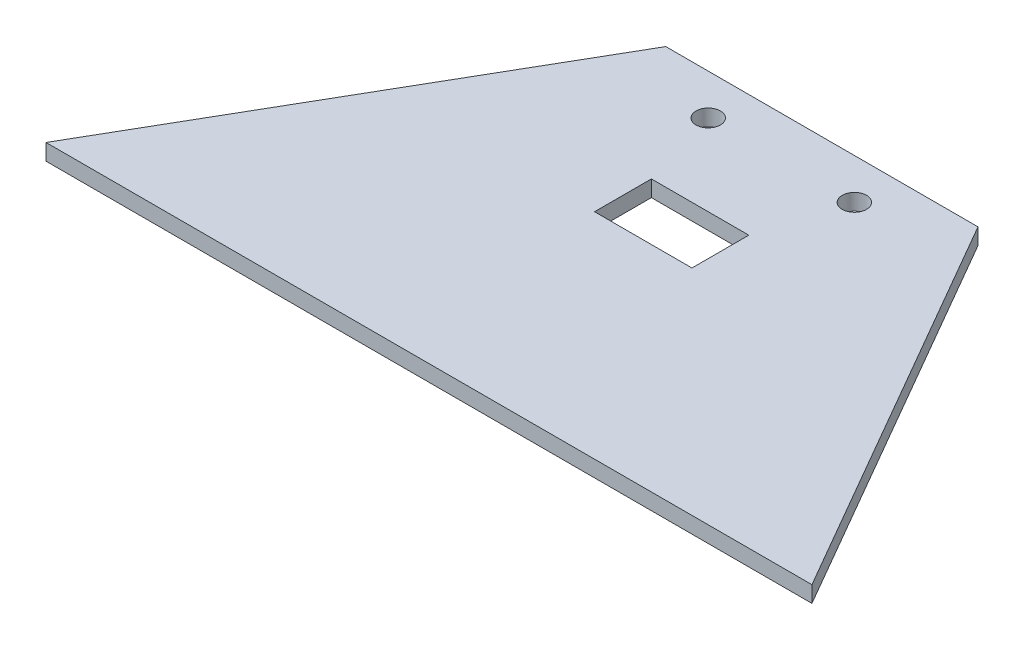
ISO-10303-21;
HEADER;
FILE_DESCRIPTION(('STEP AP214'),'2;1');
FILE_NAME('part.step','',(''),(''),'','','');
FILE_SCHEMA(('AUTOMOTIVE_DESIGN { 1 0 10303 214 1 1 1 1 }'));
ENDSEC;
DATA;
#1=APPLICATION_CONTEXT('core data for automotive mechanical design processes');
#2=APPLICATION_PROTOCOL_DEFINITION('international standard','automotive_design',2000,#1);
#3=PRODUCT_CONTEXT('',#1,'mechanical');
#4=PRODUCT('Part','Part','',(#3));
#5=PRODUCT_RELATED_PRODUCT_CATEGORY('part','',(#4));
#6=PRODUCT_DEFINITION_FORMATION('','',#4);
#7=PRODUCT_DEFINITION_CONTEXT('part definition',#1,'design');
#8=PRODUCT_DEFINITION('design','',#6,#7);
#9=PRODUCT_DEFINITION_SHAPE('','',#8);
#10=(LENGTH_UNIT() NAMED_UNIT(*) SI_UNIT(.MILLI.,.METRE.));
#11=(NAMED_UNIT(*) PLANE_ANGLE_UNIT() SI_UNIT($,.RADIAN.));
#12=(NAMED_UNIT(*) SI_UNIT($,.STERADIAN.) SOLID_ANGLE_UNIT());
#13=UNCERTAINTY_MEASURE_WITH_UNIT(LENGTH_MEASURE(1.E-05),#10,'distance_accuracy_value','');
#14=(GEOMETRIC_REPRESENTATION_CONTEXT(3) GLOBAL_UNCERTAINTY_ASSIGNED_CONTEXT((#13)) GLOBAL_UNIT_ASSIGNED_CONTEXT((#10,
#11,#12)) REPRESENTATION_CONTEXT('',''));
#15=CARTESIAN_POINT('',(0.,0.,0.));
#16=DIRECTION('',(0.,0.,1.));
#17=DIRECTION('',(1.,0.,0.));
#18=AXIS2_PLACEMENT_3D('',#15,#16,#17);
#19=CARTESIAN_POINT('',(20.135868436399,2.,-39.1327219471372));
#20=DIRECTION('',(0.,-1.,0.));
#21=DIRECTION('',(0.,0.,-1.));
#22=AXIS2_PLACEMENT_3D('',#19,#20,#21);
#23=PLANE('',#22);
#24=DIRECTION('',(1.,0.,0.));
#25=VECTOR('',#24,1.);
#26=CARTESIAN_POINT('',(6.90937112829526,2.,-17.1327219471372));
#27=LINE('',#26,#25);
#28=CARTESIAN_POINT('',(-5.09062887170475,2.,-17.1327219471372));
#29=VERTEX_POINT('',#28);
#30=CARTESIAN_POINT('',(6.90937112829526,2.,-17.1327219471372));
#31=VERTEX_POINT('',#30);
#32=EDGE_CURVE('E96',#29,#31,#27,.T.);
#33=ORIENTED_EDGE('',*,*,#32,.F.);
#34=DIRECTION('',(0.,0.,1.));
#35=VECTOR('',#34,1.);
#36=CARTESIAN_POINT('',(-5.09062887170474,2.,-24.1327219471372));
#37=LINE('',#36,#35);
#38=CARTESIAN_POINT('',(-5.09062887170474,2.,-24.1327219471372));
#39=VERTEX_POINT('',#38);
#40=EDGE_CURVE('E119',#39,#29,#37,.T.);
#41=ORIENTED_EDGE('',*,*,#40,.F.);
#42=DIRECTION('',(-1.,0.,0.));
#43=VECTOR('',#42,1.);
#44=CARTESIAN_POINT('',(-5.09062887170474,2.,-24.1327219471372));
#45=LINE('',#44,#43);
#46=CARTESIAN_POINT('',(6.90937112829526,2.,-24.1327219471372));
#47=VERTEX_POINT('',#46);
#48=EDGE_CURVE('E117',#47,#39,#45,.T.);
#49=ORIENTED_EDGE('',*,*,#48,.F.);
#50=DIRECTION('',(0.,0.,-1.));
#51=VECTOR('',#50,1.);
#52=CARTESIAN_POINT('',(6.90937112829526,2.,-24.1327219471372));
#53=LINE('',#52,#51);
#54=EDGE_CURVE('E104',#31,#47,#53,.T.);
#55=ORIENTED_EDGE('',*,*,#54,.F.);
#56=EDGE_LOOP('',(#33,#41,#49,#55));
#57=FACE_BOUND('',#56,.T.);
#58=DIRECTION('',(-0.500000000000002,0.,-0.866025403784438));
#59=VECTOR('',#58,1.);
#60=CARTESIAN_POINT('',(48.0744346377564,2.,9.25829420424034));
#61=LINE('',#60,#59);
#62=CARTESIAN_POINT('',(48.0744346377564,2.,9.25829420424034));
#63=VERTEX_POINT('',#62);
#64=CARTESIAN_POINT('',(20.135868436399,2.,-39.1327219471372));
#65=VERTEX_POINT('',#64);
#66=EDGE_CURVE('E141',#63,#65,#61,.T.);
#67=ORIENTED_EDGE('',*,*,#66,.T.);
#68=DIRECTION('',(-1.,0.,0.));
#69=VECTOR('',#68,1.);
#70=CARTESIAN_POINT('',(-18.3171261798084,2.,-39.1327219471372));
#71=LINE('',#70,#69);
#72=CARTESIAN_POINT('',(-18.3171261798084,2.,-39.1327219471372));
#73=VERTEX_POINT('',#72);
#74=EDGE_CURVE('E144',#65,#73,#71,.T.);
#75=ORIENTED_EDGE('',*,*,#74,.T.);
#76=DIRECTION('',(-0.500000000000002,0.,0.866025403784438));
#77=VECTOR('',#76,1.);
#78=CARTESIAN_POINT('',(-46.2556923811659,2.,9.25829420424034));
#79=LINE('',#78,#77);
#80=CARTESIAN_POINT('',(-46.2556923811659,2.,9.25829420424034));
#81=VERTEX_POINT('',#80);
#82=EDGE_CURVE('E147',#73,#81,#79,.T.);
#83=ORIENTED_EDGE('',*,*,#82,.T.);
#84=DIRECTION('',(1.,0.,0.));
#85=VECTOR('',#84,1.);
#86=CARTESIAN_POINT('',(-46.2556923811659,2.,9.25829420424034));
#87=LINE('',#86,#85);
#88=EDGE_CURVE('E149',#81,#63,#87,.T.);
#89=ORIENTED_EDGE('',*,*,#88,.T.);
#90=EDGE_LOOP('',(#67,#75,#83,#89));
#91=FACE_BOUND('',#90,.T.);
#92=CARTESIAN_POINT('',(-8.09062887170474,2.,-34.1327219471372));
#93=DIRECTION('',(0.,1.,0.));
#94=DIRECTION('',(0.,0.,1.));
#95=AXIS2_PLACEMENT_3D('',#92,#93,#94);
#96=CIRCLE('',#95,1.5);
#97=CARTESIAN_POINT('',(-8.09062887170474,2.,-32.6327219471372));
#98=VERTEX_POINT('',#97);
#99=EDGE_CURVE('E135',#98,#98,#96,.T.);
#100=ORIENTED_EDGE('',*,*,#99,.F.);
#101=EDGE_LOOP('',(#100));
#102=FACE_BOUND('',#101,.T.);
#103=CARTESIAN_POINT('',(9.90937112829526,2.,-34.1327219471372));
#104=DIRECTION('',(0.,1.,0.));
#105=DIRECTION('',(0.,0.,1.));
#106=AXIS2_PLACEMENT_3D('',#103,#104,#105);
#107=CIRCLE('',#106,1.5);
#108=CARTESIAN_POINT('',(9.90937112829526,2.,-32.6327219471372));
#109=VERTEX_POINT('',#108);
#110=EDGE_CURVE('E125',#109,#109,#107,.T.);
#111=ORIENTED_EDGE('',*,*,#110,.F.);
#112=EDGE_LOOP('',(#111));
#113=FACE_BOUND('',#112,.T.);
#114=ADVANCED_FACE('F31',(#57,#91,#102,#113),#23,.F.);
#115=CARTESIAN_POINT('',(20.135868436399,0.,-39.1327219471372));
#116=DIRECTION('',(0.,-1.,0.));
#117=DIRECTION('',(0.,0.,-1.));
#118=AXIS2_PLACEMENT_3D('',#115,#116,#117);
#119=PLANE('',#118);
#120=DIRECTION('',(0.,0.,1.));
#121=VECTOR('',#120,1.);
#122=CARTESIAN_POINT('',(-5.09062887170474,0.,-24.1327219471372));
#123=LINE('',#122,#121);
#124=CARTESIAN_POINT('',(-5.09062887170474,0.,-24.1327219471372));
#125=VERTEX_POINT('',#124);
#126=CARTESIAN_POINT('',(-5.09062887170474,0.,-17.1327219471372));
#127=VERTEX_POINT('',#126);
#128=EDGE_CURVE('E105',#125,#127,#123,.T.);
#129=ORIENTED_EDGE('',*,*,#128,.T.);
#130=DIRECTION('',(1.,0.,0.));
#131=VECTOR('',#130,1.);
#132=CARTESIAN_POINT('',(6.90937112829526,0.,-17.1327219471372));
#133=LINE('',#132,#131);
#134=CARTESIAN_POINT('',(6.90937112829526,0.,-17.1327219471372));
#135=VERTEX_POINT('',#134);
#136=EDGE_CURVE('E54',#127,#135,#133,.T.);
#137=ORIENTED_EDGE('',*,*,#136,.T.);
#138=DIRECTION('',(0.,0.,-1.));
#139=VECTOR('',#138,1.);
#140=CARTESIAN_POINT('',(6.90937112829526,0.,-24.1327219471372));
#141=LINE('',#140,#139);
#142=CARTESIAN_POINT('',(6.90937112829526,0.,-24.1327219471372));
#143=VERTEX_POINT('',#142);
#144=EDGE_CURVE('E111',#135,#143,#141,.T.);
#145=ORIENTED_EDGE('',*,*,#144,.T.);
#146=DIRECTION('',(-1.,0.,0.));
#147=VECTOR('',#146,1.);
#148=CARTESIAN_POINT('',(-5.09062887170474,0.,-24.1327219471372));
#149=LINE('',#148,#147);
#150=EDGE_CURVE('E127',#143,#125,#149,.T.);
#151=ORIENTED_EDGE('',*,*,#150,.T.);
#152=EDGE_LOOP('',(#129,#137,#145,#151));
#153=FACE_BOUND('',#152,.T.);
#154=DIRECTION('',(-0.500000000000002,0.,-0.866025403784438));
#155=VECTOR('',#154,1.);
#156=CARTESIAN_POINT('',(48.0744346377564,0.,9.25829420424034));
#157=LINE('',#156,#155);
#158=CARTESIAN_POINT('',(48.0744346377564,0.,9.25829420424034));
#159=VERTEX_POINT('',#158);
#160=CARTESIAN_POINT('',(20.135868436399,0.,-39.1327219471372));
#161=VERTEX_POINT('',#160);
#162=EDGE_CURVE('E138',#159,#161,#157,.T.);
#163=ORIENTED_EDGE('',*,*,#162,.F.);
#164=DIRECTION('',(1.,0.,0.));
#165=VECTOR('',#164,1.);
#166=CARTESIAN_POINT('',(-46.2556923811659,0.,9.25829420424034));
#167=LINE('',#166,#165);
#168=CARTESIAN_POINT('',(-46.2556923811659,0.,9.25829420424034));
#169=VERTEX_POINT('',#168);
#170=EDGE_CURVE('E145',#169,#159,#167,.T.);
#171=ORIENTED_EDGE('',*,*,#170,.F.);
#172=DIRECTION('',(-0.500000000000002,0.,0.866025403784438));
#173=VECTOR('',#172,1.);
#174=CARTESIAN_POINT('',(-46.2556923811659,0.,9.25829420424034));
#175=LINE('',#174,#173);
#176=CARTESIAN_POINT('',(-18.3171261798084,0.,-39.1327219471372));
#177=VERTEX_POINT('',#176);
#178=EDGE_CURVE('E156',#177,#169,#175,.T.);
#179=ORIENTED_EDGE('',*,*,#178,.F.);
#180=DIRECTION('',(-1.,0.,0.));
#181=VECTOR('',#180,1.);
#182=CARTESIAN_POINT('',(-18.3171261798084,0.,-39.1327219471372));
#183=LINE('',#182,#181);
#184=EDGE_CURVE('E154',#161,#177,#183,.T.);
#185=ORIENTED_EDGE('',*,*,#184,.F.);
#186=EDGE_LOOP('',(#163,#171,#179,#185));
#187=FACE_BOUND('',#186,.T.);
#188=CARTESIAN_POINT('',(-8.09062887170474,0.,-34.1327219471372));
#189=DIRECTION('',(0.,1.,0.));
#190=DIRECTION('',(0.,0.,1.));
#191=AXIS2_PLACEMENT_3D('',#188,#189,#190);
#192=CIRCLE('',#191,1.5);
#193=CARTESIAN_POINT('',(-8.09062887170474,0.,-32.6327219471372));
#194=VERTEX_POINT('',#193);
#195=EDGE_CURVE('E112',#194,#194,#192,.T.);
#196=ORIENTED_EDGE('',*,*,#195,.T.);
#197=EDGE_LOOP('',(#196));
#198=FACE_BOUND('',#197,.T.);
#199=CARTESIAN_POINT('',(9.90937112829526,0.,-34.1327219471372));
#200=DIRECTION('',(0.,1.,0.));
#201=DIRECTION('',(0.,0.,1.));
#202=AXIS2_PLACEMENT_3D('',#199,#200,#201);
#203=CIRCLE('',#202,1.5);
#204=CARTESIAN_POINT('',(9.90937112829526,0.,-32.6327219471372));
#205=VERTEX_POINT('',#204);
#206=EDGE_CURVE('E216',#205,#205,#203,.T.);
#207=ORIENTED_EDGE('',*,*,#206,.T.);
#208=EDGE_LOOP('',(#207));
#209=FACE_BOUND('',#208,.T.);
#210=ADVANCED_FACE('F174',(#153,#187,#198,#209),#119,.T.);
#211=CARTESIAN_POINT('',(48.0744346377564,2.,9.25829420424034));
#212=DIRECTION('',(-0.866025403784438,0.,0.500000000000002));
#213=DIRECTION('',(0.500000000000002,0.,0.866025403784438));
#214=AXIS2_PLACEMENT_3D('',#211,#212,#213);
#215=PLANE('',#214);
#216=ORIENTED_EDGE('',*,*,#162,.T.);
#217=DIRECTION('',(0.,-1.,0.));
#218=VECTOR('',#217,1.);
#219=CARTESIAN_POINT('',(20.135868436399,2.,-39.1327219471372));
#220=LINE('',#219,#218);
#221=EDGE_CURVE('E11',#65,#161,#220,.T.);
#222=ORIENTED_EDGE('',*,*,#221,.F.);
#223=ORIENTED_EDGE('',*,*,#66,.F.);
#224=DIRECTION('',(0.,-1.,0.));
#225=VECTOR('',#224,1.);
#226=CARTESIAN_POINT('',(48.0744346377564,2.,9.25829420424034));
#227=LINE('',#226,#225);
#228=EDGE_CURVE('E151',#63,#159,#227,.T.);
#229=ORIENTED_EDGE('',*,*,#228,.T.);
#230=EDGE_LOOP('',(#216,#222,#223,#229));
#231=FACE_BOUND('',#230,.T.);
#232=ADVANCED_FACE('F33',(#231),#215,.F.);
#233=CARTESIAN_POINT('',(-18.3171261798084,2.,-39.1327219471372));
#234=DIRECTION('',(0.,0.,1.));
#235=DIRECTION('',(1.,0.,0.));
#236=AXIS2_PLACEMENT_3D('',#233,#234,#235);
#237=PLANE('',#236);
#238=ORIENTED_EDGE('',*,*,#184,.T.);
#239=DIRECTION('',(0.,-1.,0.));
#240=VECTOR('',#239,1.);
#241=CARTESIAN_POINT('',(-18.3171261798084,2.,-39.1327219471372));
#242=LINE('',#241,#240);
#243=EDGE_CURVE('E39',#73,#177,#242,.T.);
#244=ORIENTED_EDGE('',*,*,#243,.F.);
#245=ORIENTED_EDGE('',*,*,#74,.F.);
#246=ORIENTED_EDGE('',*,*,#221,.T.);
#247=EDGE_LOOP('',(#238,#244,#245,#246));
#248=FACE_BOUND('',#247,.T.);
#249=ADVANCED_FACE('F184',(#248),#237,.F.);
#250=CARTESIAN_POINT('',(-46.2556923811659,2.,9.25829420424034));
#251=DIRECTION('',(0.866025403784438,0.,0.500000000000002));
#252=DIRECTION('',(0.500000000000002,0.,-0.866025403784438));
#253=AXIS2_PLACEMENT_3D('',#250,#251,#252);
#254=PLANE('',#253);
#255=ORIENTED_EDGE('',*,*,#178,.T.);
#256=DIRECTION('',(0.,-1.,0.));
#257=VECTOR('',#256,1.);
#258=CARTESIAN_POINT('',(-46.2556923811659,2.,9.25829420424034));
#259=LINE('',#258,#257);
#260=EDGE_CURVE('E161',#81,#169,#259,.T.);
#261=ORIENTED_EDGE('',*,*,#260,.F.);
#262=ORIENTED_EDGE('',*,*,#82,.F.);
#263=ORIENTED_EDGE('',*,*,#243,.T.);
#264=EDGE_LOOP('',(#255,#261,#262,#263));
#265=FACE_BOUND('',#264,.T.);
#266=ADVANCED_FACE('F168',(#265),#254,.F.);
#267=CARTESIAN_POINT('',(-46.2556923811659,2.,9.25829420424034));
#268=DIRECTION('',(0.,0.,-1.));
#269=DIRECTION('',(-1.,0.,0.));
#270=AXIS2_PLACEMENT_3D('',#267,#268,#269);
#271=PLANE('',#270);
#272=ORIENTED_EDGE('',*,*,#170,.T.);
#273=ORIENTED_EDGE('',*,*,#228,.F.);
#274=ORIENTED_EDGE('',*,*,#88,.F.);
#275=ORIENTED_EDGE('',*,*,#260,.T.);
#276=EDGE_LOOP('',(#272,#273,#274,#275));
#277=FACE_BOUND('',#276,.T.);
#278=ADVANCED_FACE('F178',(#277),#271,.F.);
#279=CARTESIAN_POINT('',(-8.09062887170474,2.,-34.1327219471372));
#280=DIRECTION('',(0.,-1.,0.));
#281=DIRECTION('',(0.,0.,-1.));
#282=AXIS2_PLACEMENT_3D('',#279,#280,#281);
#283=CYLINDRICAL_SURFACE('',#282,1.5);
#284=ORIENTED_EDGE('',*,*,#99,.T.);
#285=EDGE_LOOP('',(#284));
#286=FACE_BOUND('',#285,.T.);
#287=ORIENTED_EDGE('',*,*,#195,.F.);
#288=EDGE_LOOP('',(#287));
#289=FACE_BOUND('',#288,.T.);
#290=ADVANCED_FACE('F199',(#286,#289),#283,.F.);
#291=CARTESIAN_POINT('',(6.90937112829526,2.,-17.1327219471372));
#292=DIRECTION('',(0.,0.,-1.));
#293=DIRECTION('',(-1.,0.,0.));
#294=AXIS2_PLACEMENT_3D('',#291,#292,#293);
#295=PLANE('',#294);
#296=ORIENTED_EDGE('',*,*,#136,.F.);
#297=DIRECTION('',(0.,-1.,0.));
#298=VECTOR('',#297,1.);
#299=CARTESIAN_POINT('',(-5.09062887170475,2.,-17.1327219471372));
#300=LINE('',#299,#298);
#301=EDGE_CURVE('E100',#29,#127,#300,.T.);
#302=ORIENTED_EDGE('',*,*,#301,.F.);
#303=ORIENTED_EDGE('',*,*,#32,.T.);
#304=DIRECTION('',(0.,-1.,0.));
#305=VECTOR('',#304,1.);
#306=CARTESIAN_POINT('',(6.90937112829526,2.,-17.1327219471372));
#307=LINE('',#306,#305);
#308=EDGE_CURVE('E99',#31,#135,#307,.T.);
#309=ORIENTED_EDGE('',*,*,#308,.T.);
#310=EDGE_LOOP('',(#296,#302,#303,#309));
#311=FACE_BOUND('',#310,.T.);
#312=ADVANCED_FACE('F98',(#311),#295,.T.);
#313=CARTESIAN_POINT('',(6.90937112829526,2.,-24.1327219471372));
#314=DIRECTION('',(-1.,0.,0.));
#315=DIRECTION('',(0.,0.,1.));
#316=AXIS2_PLACEMENT_3D('',#313,#314,#315);
#317=PLANE('',#316);
#318=ORIENTED_EDGE('',*,*,#144,.F.);
#319=ORIENTED_EDGE('',*,*,#308,.F.);
#320=ORIENTED_EDGE('',*,*,#54,.T.);
#321=DIRECTION('',(0.,-1.,0.));
#322=VECTOR('',#321,1.);
#323=CARTESIAN_POINT('',(6.90937112829526,2.,-24.1327219471372));
#324=LINE('',#323,#322);
#325=EDGE_CURVE('E113',#47,#143,#324,.T.);
#326=ORIENTED_EDGE('',*,*,#325,.T.);
#327=EDGE_LOOP('',(#318,#319,#320,#326));
#328=FACE_BOUND('',#327,.T.);
#329=ADVANCED_FACE('F108',(#328),#317,.T.);
#330=CARTESIAN_POINT('',(-5.09062887170474,2.,-24.1327219471372));
#331=DIRECTION('',(0.,0.,1.));
#332=DIRECTION('',(1.,0.,0.));
#333=AXIS2_PLACEMENT_3D('',#330,#331,#332);
#334=PLANE('',#333);
#335=ORIENTED_EDGE('',*,*,#150,.F.);
#336=ORIENTED_EDGE('',*,*,#325,.F.);
#337=ORIENTED_EDGE('',*,*,#48,.T.);
#338=DIRECTION('',(0.,-1.,0.));
#339=VECTOR('',#338,1.);
#340=CARTESIAN_POINT('',(-5.09062887170474,2.,-24.1327219471372));
#341=LINE('',#340,#339);
#342=EDGE_CURVE('E46',#39,#125,#341,.T.);
#343=ORIENTED_EDGE('',*,*,#342,.T.);
#344=EDGE_LOOP('',(#335,#336,#337,#343));
#345=FACE_BOUND('',#344,.T.);
#346=ADVANCED_FACE('F230',(#345),#334,.T.);
#347=CARTESIAN_POINT('',(-5.09062887170474,2.,-24.1327219471372));
#348=DIRECTION('',(1.,0.,0.));
#349=DIRECTION('',(0.,0.,-1.));
#350=AXIS2_PLACEMENT_3D('',#347,#348,#349);
#351=PLANE('',#350);
#352=ORIENTED_EDGE('',*,*,#128,.F.);
#353=ORIENTED_EDGE('',*,*,#342,.F.);
#354=ORIENTED_EDGE('',*,*,#40,.T.);
#355=ORIENTED_EDGE('',*,*,#301,.T.);
#356=EDGE_LOOP('',(#352,#353,#354,#355));
#357=FACE_BOUND('',#356,.T.);
#358=ADVANCED_FACE('F225',(#357),#351,.T.);
#359=CARTESIAN_POINT('',(9.90937112829526,2.,-34.1327219471372));
#360=DIRECTION('',(0.,-1.,0.));
#361=DIRECTION('',(0.,0.,-1.));
#362=AXIS2_PLACEMENT_3D('',#359,#360,#361);
#363=CYLINDRICAL_SURFACE('',#362,1.5);
#364=ORIENTED_EDGE('',*,*,#110,.T.);
#365=EDGE_LOOP('',(#364));
#366=FACE_BOUND('',#365,.T.);
#367=ORIENTED_EDGE('',*,*,#206,.F.);
#368=EDGE_LOOP('',(#367));
#369=FACE_BOUND('',#368,.T.);
#370=ADVANCED_FACE('F222',(#366,#369),#363,.F.);
#371=CLOSED_SHELL('',(#114,#210,#232,#249,#266,#278,#290,#312,#329,#346,#358,#370));
#372=MANIFOLD_SOLID_BREP('B2',#371);
#373=ADVANCED_BREP_SHAPE_REPRESENTATION('',(#18,#372),#14);
#374=SHAPE_DEFINITION_REPRESENTATION(#9,#373);
ENDSEC;
END-ISO-10303-21;
